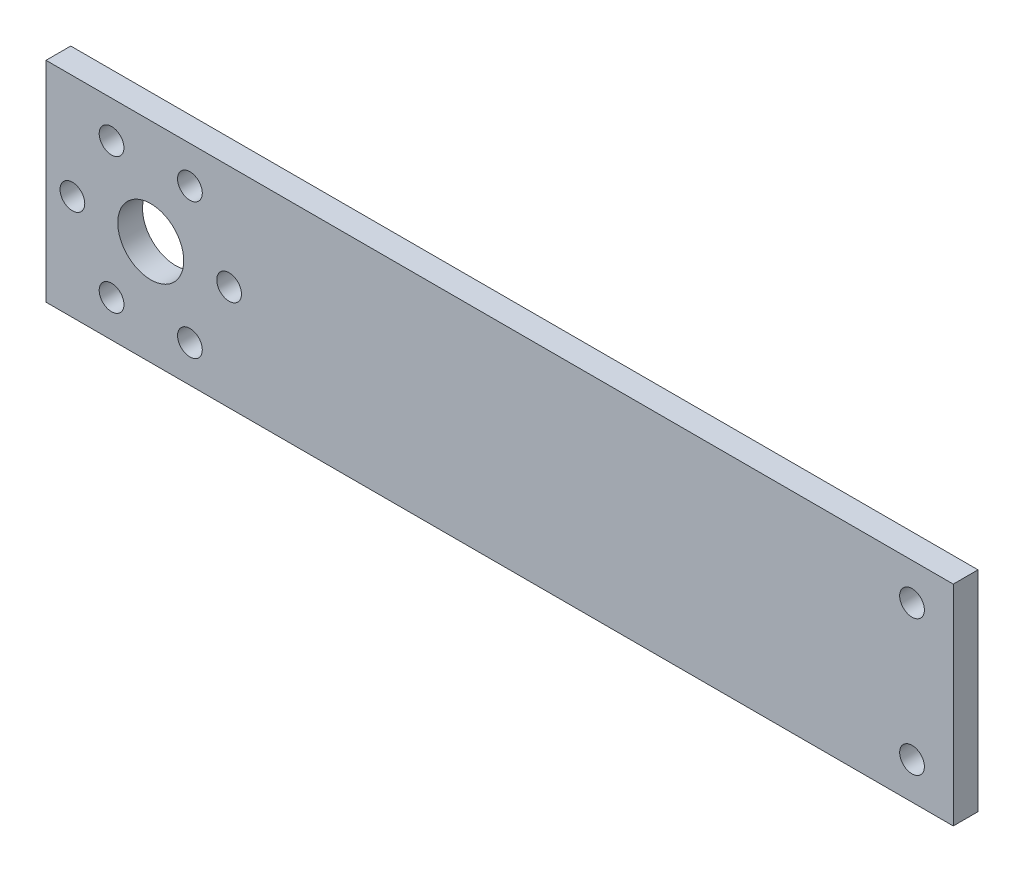
ISO-10303-21;
HEADER;
FILE_DESCRIPTION(('STEP AP214'),'2;1');
FILE_NAME('part.step','',(''),(''),'','','');
FILE_SCHEMA(('AUTOMOTIVE_DESIGN { 1 0 10303 214 1 1 1 1 }'));
ENDSEC;
DATA;
#1=APPLICATION_CONTEXT('core data for automotive mechanical design processes');
#2=APPLICATION_PROTOCOL_DEFINITION('international standard','automotive_design',2000,#1);
#3=PRODUCT_CONTEXT('',#1,'mechanical');
#4=PRODUCT('Part','Part','',(#3));
#5=PRODUCT_RELATED_PRODUCT_CATEGORY('part','',(#4));
#6=PRODUCT_DEFINITION_FORMATION('','',#4);
#7=PRODUCT_DEFINITION_CONTEXT('part definition',#1,'design');
#8=PRODUCT_DEFINITION('design','',#6,#7);
#9=PRODUCT_DEFINITION_SHAPE('','',#8);
#10=(LENGTH_UNIT() NAMED_UNIT(*) SI_UNIT(.MILLI.,.METRE.));
#11=(NAMED_UNIT(*) PLANE_ANGLE_UNIT() SI_UNIT($,.RADIAN.));
#12=(NAMED_UNIT(*) SI_UNIT($,.STERADIAN.) SOLID_ANGLE_UNIT());
#13=UNCERTAINTY_MEASURE_WITH_UNIT(LENGTH_MEASURE(1.E-05),#10,'distance_accuracy_value','');
#14=(GEOMETRIC_REPRESENTATION_CONTEXT(3) GLOBAL_UNCERTAINTY_ASSIGNED_CONTEXT((#13)) GLOBAL_UNIT_ASSIGNED_CONTEXT((#10,
#11,#12)) REPRESENTATION_CONTEXT('',''));
#15=CARTESIAN_POINT('',(0.,0.,0.));
#16=DIRECTION('',(0.,0.,1.));
#17=DIRECTION('',(1.,0.,0.));
#18=AXIS2_PLACEMENT_3D('',#15,#16,#17);
#19=CARTESIAN_POINT('',(110.,0.,3.));
#20=DIRECTION('',(1.,0.,0.));
#21=DIRECTION('',(0.,1.,0.));
#22=AXIS2_PLACEMENT_3D('',#19,#20,#21);
#23=PLANE('',#22);
#24=DIRECTION('',(0.,0.,1.));
#25=VECTOR('',#24,1.);
#26=CARTESIAN_POINT('',(110.,-25.4,3.));
#27=LINE('',#26,#25);
#28=CARTESIAN_POINT('',(110.,-25.4,0.));
#29=VERTEX_POINT('',#28);
#30=CARTESIAN_POINT('',(110.,-25.4,3.));
#31=VERTEX_POINT('',#30);
#32=EDGE_CURVE('E11',#29,#31,#27,.T.);
#33=ORIENTED_EDGE('',*,*,#32,.F.);
#34=DIRECTION('',(0.,1.,0.));
#35=VECTOR('',#34,1.);
#36=CARTESIAN_POINT('',(110.,0.,0.));
#37=LINE('',#36,#35);
#38=CARTESIAN_POINT('',(110.,0.,0.));
#39=VERTEX_POINT('',#38);
#40=EDGE_CURVE('E93',#29,#39,#37,.T.);
#41=ORIENTED_EDGE('',*,*,#40,.T.);
#42=DIRECTION('',(0.,0.,1.));
#43=VECTOR('',#42,1.);
#44=CARTESIAN_POINT('',(110.,0.,3.));
#45=LINE('',#44,#43);
#46=CARTESIAN_POINT('',(110.,0.,3.));
#47=VERTEX_POINT('',#46);
#48=EDGE_CURVE('E47',#39,#47,#45,.T.);
#49=ORIENTED_EDGE('',*,*,#48,.T.);
#50=DIRECTION('',(0.,1.,0.));
#51=VECTOR('',#50,1.);
#52=CARTESIAN_POINT('',(110.,0.,3.));
#53=LINE('',#52,#51);
#54=EDGE_CURVE('E124',#31,#47,#53,.T.);
#55=ORIENTED_EDGE('',*,*,#54,.F.);
#56=EDGE_LOOP('',(#33,#41,#49,#55));
#57=FACE_BOUND('',#56,.T.);
#58=ADVANCED_FACE('F37',(#57),#23,.T.);
#59=CARTESIAN_POINT('',(0.,0.,3.));
#60=DIRECTION('',(0.,1.,0.));
#61=DIRECTION('',(-1.,0.,0.));
#62=AXIS2_PLACEMENT_3D('',#59,#60,#61);
#63=PLANE('',#62);
#64=ORIENTED_EDGE('',*,*,#48,.F.);
#65=DIRECTION('',(1.,0.,0.));
#66=VECTOR('',#65,1.);
#67=CARTESIAN_POINT('',(0.,0.,0.));
#68=LINE('',#67,#66);
#69=CARTESIAN_POINT('',(0.,0.,0.));
#70=VERTEX_POINT('',#69);
#71=EDGE_CURVE('E103',#39,#70,#68,.F.);
#72=ORIENTED_EDGE('',*,*,#71,.T.);
#73=DIRECTION('',(0.,0.,1.));
#74=VECTOR('',#73,1.);
#75=CARTESIAN_POINT('',(0.,0.,3.));
#76=LINE('',#75,#74);
#77=CARTESIAN_POINT('',(0.,0.,3.));
#78=VERTEX_POINT('',#77);
#79=EDGE_CURVE('E55',#70,#78,#76,.T.);
#80=ORIENTED_EDGE('',*,*,#79,.T.);
#81=DIRECTION('',(-1.,0.,0.));
#82=VECTOR('',#81,1.);
#83=CARTESIAN_POINT('',(0.,0.,3.));
#84=LINE('',#83,#82);
#85=EDGE_CURVE('E129',#47,#78,#84,.T.);
#86=ORIENTED_EDGE('',*,*,#85,.F.);
#87=EDGE_LOOP('',(#64,#72,#80,#86));
#88=FACE_BOUND('',#87,.T.);
#89=ADVANCED_FACE('F131',(#88),#63,.T.);
#90=CARTESIAN_POINT('',(0.,0.,3.));
#91=DIRECTION('',(-1.,0.,0.));
#92=DIRECTION('',(0.,-1.,0.));
#93=AXIS2_PLACEMENT_3D('',#90,#91,#92);
#94=PLANE('',#93);
#95=ORIENTED_EDGE('',*,*,#79,.F.);
#96=DIRECTION('',(0.,1.,0.));
#97=VECTOR('',#96,1.);
#98=CARTESIAN_POINT('',(0.,0.,0.));
#99=LINE('',#98,#97);
#100=CARTESIAN_POINT('',(0.,-25.4,0.));
#101=VERTEX_POINT('',#100);
#102=EDGE_CURVE('E92',#70,#101,#99,.F.);
#103=ORIENTED_EDGE('',*,*,#102,.T.);
#104=DIRECTION('',(0.,0.,1.));
#105=VECTOR('',#104,1.);
#106=CARTESIAN_POINT('',(0.,-25.4,3.));
#107=LINE('',#106,#105);
#108=CARTESIAN_POINT('',(0.,-25.4,3.));
#109=VERTEX_POINT('',#108);
#110=EDGE_CURVE('E41',#101,#109,#107,.T.);
#111=ORIENTED_EDGE('',*,*,#110,.T.);
#112=DIRECTION('',(0.,-1.,0.));
#113=VECTOR('',#112,1.);
#114=CARTESIAN_POINT('',(0.,0.,3.));
#115=LINE('',#114,#113);
#116=EDGE_CURVE('E239',#78,#109,#115,.T.);
#117=ORIENTED_EDGE('',*,*,#116,.F.);
#118=EDGE_LOOP('',(#95,#103,#111,#117));
#119=FACE_BOUND('',#118,.T.);
#120=ADVANCED_FACE('F95',(#119),#94,.T.);
#121=CARTESIAN_POINT('',(105.,-20.9272413359522,3.));
#122=DIRECTION('',(0.,0.,1.));
#123=DIRECTION('',(1.,0.,0.));
#124=AXIS2_PLACEMENT_3D('',#121,#122,#123);
#125=CYLINDRICAL_SURFACE('',#124,1.5);
#126=CARTESIAN_POINT('',(105.,-20.9272413359522,3.));
#127=DIRECTION('',(0.,0.,1.));
#128=DIRECTION('',(1.,0.,0.));
#129=AXIS2_PLACEMENT_3D('',#126,#127,#128);
#130=CIRCLE('',#129,1.5);
#131=CARTESIAN_POINT('',(106.5,-20.9272413359522,3.));
#132=VERTEX_POINT('',#131);
#133=EDGE_CURVE('E121',#132,#132,#130,.T.);
#134=ORIENTED_EDGE('',*,*,#133,.T.);
#135=EDGE_LOOP('',(#134));
#136=FACE_BOUND('',#135,.T.);
#137=CARTESIAN_POINT('',(105.,-20.9272413359522,0.));
#138=DIRECTION('',(0.,0.,1.));
#139=DIRECTION('',(1.,0.,0.));
#140=AXIS2_PLACEMENT_3D('',#137,#138,#139);
#141=CIRCLE('',#140,1.5);
#142=CARTESIAN_POINT('',(106.5,-20.9272413359522,0.));
#143=VERTEX_POINT('',#142);
#144=EDGE_CURVE('E149',#143,#143,#141,.T.);
#145=ORIENTED_EDGE('',*,*,#144,.F.);
#146=EDGE_LOOP('',(#145));
#147=FACE_BOUND('',#146,.T.);
#148=ADVANCED_FACE('F171',(#136,#147),#125,.F.);
#149=CARTESIAN_POINT('',(17.4499999999999,-20.9272413359522,3.));
#150=DIRECTION('',(0.,0.,1.));
#151=DIRECTION('',(1.,0.,0.));
#152=AXIS2_PLACEMENT_3D('',#149,#150,#151);
#153=CYLINDRICAL_SURFACE('',#152,1.5);
#154=CARTESIAN_POINT('',(17.4499999999999,-20.9272413359522,3.));
#155=DIRECTION('',(0.,0.,1.));
#156=DIRECTION('',(1.,0.,0.));
#157=AXIS2_PLACEMENT_3D('',#154,#155,#156);
#158=CIRCLE('',#157,1.5);
#159=CARTESIAN_POINT('',(18.9499999999999,-20.9272413359522,3.));
#160=VERTEX_POINT('',#159);
#161=EDGE_CURVE('E229',#160,#160,#158,.T.);
#162=ORIENTED_EDGE('',*,*,#161,.T.);
#163=EDGE_LOOP('',(#162));
#164=FACE_BOUND('',#163,.T.);
#165=CARTESIAN_POINT('',(17.4499999999999,-20.9272413359522,0.));
#166=DIRECTION('',(0.,0.,1.));
#167=DIRECTION('',(1.,0.,0.));
#168=AXIS2_PLACEMENT_3D('',#165,#166,#167);
#169=CIRCLE('',#168,1.5);
#170=CARTESIAN_POINT('',(18.9499999999999,-20.9272413359522,0.));
#171=VERTEX_POINT('',#170);
#172=EDGE_CURVE('E152',#171,#171,#169,.T.);
#173=ORIENTED_EDGE('',*,*,#172,.F.);
#174=EDGE_LOOP('',(#173));
#175=FACE_BOUND('',#174,.T.);
#176=ADVANCED_FACE('F162',(#164,#175),#153,.F.);
#177=CARTESIAN_POINT('',(17.45,-4.47275866404785,3.));
#178=DIRECTION('',(0.,0.,1.));
#179=DIRECTION('',(1.,0.,0.));
#180=AXIS2_PLACEMENT_3D('',#177,#178,#179);
#181=CYLINDRICAL_SURFACE('',#180,1.5);
#182=CARTESIAN_POINT('',(17.45,-4.47275866404785,3.));
#183=DIRECTION('',(0.,0.,1.));
#184=DIRECTION('',(1.,0.,0.));
#185=AXIS2_PLACEMENT_3D('',#182,#183,#184);
#186=CIRCLE('',#185,1.5);
#187=CARTESIAN_POINT('',(18.95,-4.47275866404785,3.));
#188=VERTEX_POINT('',#187);
#189=EDGE_CURVE('E232',#188,#188,#186,.T.);
#190=ORIENTED_EDGE('',*,*,#189,.T.);
#191=EDGE_LOOP('',(#190));
#192=FACE_BOUND('',#191,.T.);
#193=CARTESIAN_POINT('',(17.45,-4.47275866404785,0.));
#194=DIRECTION('',(0.,0.,1.));
#195=DIRECTION('',(1.,0.,0.));
#196=AXIS2_PLACEMENT_3D('',#193,#194,#195);
#197=CIRCLE('',#196,1.5);
#198=CARTESIAN_POINT('',(18.95,-4.47275866404785,0.));
#199=VERTEX_POINT('',#198);
#200=EDGE_CURVE('E99',#199,#199,#197,.T.);
#201=ORIENTED_EDGE('',*,*,#200,.F.);
#202=EDGE_LOOP('',(#201));
#203=FACE_BOUND('',#202,.T.);
#204=ADVANCED_FACE('F159',(#192,#203),#181,.F.);
#205=CARTESIAN_POINT('',(12.7,-12.7,3.));
#206=DIRECTION('',(0.,0.,1.));
#207=DIRECTION('',(1.,0.,0.));
#208=AXIS2_PLACEMENT_3D('',#205,#206,#207);
#209=CYLINDRICAL_SURFACE('',#208,4.);
#210=CARTESIAN_POINT('',(12.7,-12.7,3.));
#211=DIRECTION('',(0.,0.,1.));
#212=DIRECTION('',(1.,0.,0.));
#213=AXIS2_PLACEMENT_3D('',#210,#211,#212);
#214=CIRCLE('',#213,4.);
#215=CARTESIAN_POINT('',(16.7,-12.7,3.));
#216=VERTEX_POINT('',#215);
#217=EDGE_CURVE('E236',#216,#216,#214,.T.);
#218=ORIENTED_EDGE('',*,*,#217,.T.);
#219=EDGE_LOOP('',(#218));
#220=FACE_BOUND('',#219,.T.);
#221=CARTESIAN_POINT('',(12.7,-12.7,0.));
#222=DIRECTION('',(0.,0.,1.));
#223=DIRECTION('',(1.,0.,0.));
#224=AXIS2_PLACEMENT_3D('',#221,#222,#223);
#225=CIRCLE('',#224,4.);
#226=CARTESIAN_POINT('',(16.7,-12.7,0.));
#227=VERTEX_POINT('',#226);
#228=EDGE_CURVE('E96',#227,#227,#225,.T.);
#229=ORIENTED_EDGE('',*,*,#228,.F.);
#230=EDGE_LOOP('',(#229));
#231=FACE_BOUND('',#230,.T.);
#232=ADVANCED_FACE('F161',(#220,#231),#209,.F.);
#233=CARTESIAN_POINT('',(0.,-25.4,3.));
#234=DIRECTION('',(0.,-1.,0.));
#235=DIRECTION('',(1.,0.,0.));
#236=AXIS2_PLACEMENT_3D('',#233,#234,#235);
#237=PLANE('',#236);
#238=DIRECTION('',(1.,0.,0.));
#239=VECTOR('',#238,1.);
#240=CARTESIAN_POINT('',(0.,-25.4,0.));
#241=LINE('',#240,#239);
#242=EDGE_CURVE('E80',#101,#29,#241,.T.);
#243=ORIENTED_EDGE('',*,*,#242,.T.);
#244=ORIENTED_EDGE('',*,*,#32,.T.);
#245=DIRECTION('',(1.,0.,0.));
#246=VECTOR('',#245,1.);
#247=CARTESIAN_POINT('',(0.,-25.4,3.));
#248=LINE('',#247,#246);
#249=EDGE_CURVE('E82',#109,#31,#248,.T.);
#250=ORIENTED_EDGE('',*,*,#249,.F.);
#251=ORIENTED_EDGE('',*,*,#110,.F.);
#252=EDGE_LOOP('',(#243,#244,#250,#251));
#253=FACE_BOUND('',#252,.T.);
#254=ADVANCED_FACE('F79',(#253),#237,.T.);
#255=CARTESIAN_POINT('',(3.2,-12.7,3.));
#256=DIRECTION('',(0.,0.,1.));
#257=DIRECTION('',(1.,0.,0.));
#258=AXIS2_PLACEMENT_3D('',#255,#256,#257);
#259=CYLINDRICAL_SURFACE('',#258,1.5);
#260=CARTESIAN_POINT('',(3.2,-12.7,3.));
#261=DIRECTION('',(0.,0.,1.));
#262=DIRECTION('',(1.,0.,0.));
#263=AXIS2_PLACEMENT_3D('',#260,#261,#262);
#264=CIRCLE('',#263,1.5);
#265=CARTESIAN_POINT('',(4.7,-12.7,3.));
#266=VERTEX_POINT('',#265);
#267=EDGE_CURVE('E132',#266,#266,#264,.T.);
#268=ORIENTED_EDGE('',*,*,#267,.T.);
#269=EDGE_LOOP('',(#268));
#270=FACE_BOUND('',#269,.T.);
#271=CARTESIAN_POINT('',(3.2,-12.7,0.));
#272=DIRECTION('',(0.,0.,1.));
#273=DIRECTION('',(1.,0.,0.));
#274=AXIS2_PLACEMENT_3D('',#271,#272,#273);
#275=CIRCLE('',#274,1.5);
#276=CARTESIAN_POINT('',(4.7,-12.7,0.));
#277=VERTEX_POINT('',#276);
#278=EDGE_CURVE('E105',#277,#277,#275,.T.);
#279=ORIENTED_EDGE('',*,*,#278,.F.);
#280=EDGE_LOOP('',(#279));
#281=FACE_BOUND('',#280,.T.);
#282=ADVANCED_FACE('F185',(#270,#281),#259,.F.);
#283=CARTESIAN_POINT('',(7.95000000000001,-4.47275866404782,3.));
#284=DIRECTION('',(0.,0.,1.));
#285=DIRECTION('',(1.,0.,0.));
#286=AXIS2_PLACEMENT_3D('',#283,#284,#285);
#287=CYLINDRICAL_SURFACE('',#286,1.5);
#288=CARTESIAN_POINT('',(7.95000000000001,-4.47275866404782,3.));
#289=DIRECTION('',(0.,0.,1.));
#290=DIRECTION('',(1.,0.,0.));
#291=AXIS2_PLACEMENT_3D('',#288,#289,#290);
#292=CIRCLE('',#291,1.5);
#293=CARTESIAN_POINT('',(9.45000000000001,-4.47275866404782,3.));
#294=VERTEX_POINT('',#293);
#295=EDGE_CURVE('E135',#294,#294,#292,.T.);
#296=ORIENTED_EDGE('',*,*,#295,.T.);
#297=EDGE_LOOP('',(#296));
#298=FACE_BOUND('',#297,.T.);
#299=CARTESIAN_POINT('',(7.95000000000001,-4.47275866404782,0.));
#300=DIRECTION('',(0.,0.,1.));
#301=DIRECTION('',(1.,0.,0.));
#302=AXIS2_PLACEMENT_3D('',#299,#300,#301);
#303=CIRCLE('',#302,1.5);
#304=CARTESIAN_POINT('',(9.45000000000001,-4.47275866404782,0.));
#305=VERTEX_POINT('',#304);
#306=EDGE_CURVE('E109',#305,#305,#303,.T.);
#307=ORIENTED_EDGE('',*,*,#306,.F.);
#308=EDGE_LOOP('',(#307));
#309=FACE_BOUND('',#308,.T.);
#310=ADVANCED_FACE('F188',(#298,#309),#287,.F.);
#311=CARTESIAN_POINT('',(22.2,-12.7000000000001,3.));
#312=DIRECTION('',(0.,0.,1.));
#313=DIRECTION('',(1.,0.,0.));
#314=AXIS2_PLACEMENT_3D('',#311,#312,#313);
#315=CYLINDRICAL_SURFACE('',#314,1.5);
#316=CARTESIAN_POINT('',(22.2,-12.7000000000001,3.));
#317=DIRECTION('',(0.,0.,1.));
#318=DIRECTION('',(1.,0.,0.));
#319=AXIS2_PLACEMENT_3D('',#316,#317,#318);
#320=CIRCLE('',#319,1.5);
#321=CARTESIAN_POINT('',(23.7,-12.7000000000001,3.));
#322=VERTEX_POINT('',#321);
#323=EDGE_CURVE('E141',#322,#322,#320,.T.);
#324=ORIENTED_EDGE('',*,*,#323,.T.);
#325=EDGE_LOOP('',(#324));
#326=FACE_BOUND('',#325,.T.);
#327=CARTESIAN_POINT('',(22.2,-12.7000000000001,0.));
#328=DIRECTION('',(0.,0.,1.));
#329=DIRECTION('',(1.,0.,0.));
#330=AXIS2_PLACEMENT_3D('',#327,#328,#329);
#331=CIRCLE('',#330,1.5);
#332=CARTESIAN_POINT('',(23.7,-12.7000000000001,0.));
#333=VERTEX_POINT('',#332);
#334=EDGE_CURVE('E112',#333,#333,#331,.T.);
#335=ORIENTED_EDGE('',*,*,#334,.F.);
#336=EDGE_LOOP('',(#335));
#337=FACE_BOUND('',#336,.T.);
#338=ADVANCED_FACE('F192',(#326,#337),#315,.F.);
#339=CARTESIAN_POINT('',(7.9499999999999,-20.9272413359521,3.));
#340=DIRECTION('',(0.,0.,1.));
#341=DIRECTION('',(1.,0.,0.));
#342=AXIS2_PLACEMENT_3D('',#339,#340,#341);
#343=CYLINDRICAL_SURFACE('',#342,1.5);
#344=CARTESIAN_POINT('',(7.9499999999999,-20.9272413359521,3.));
#345=DIRECTION('',(0.,0.,1.));
#346=DIRECTION('',(1.,0.,0.));
#347=AXIS2_PLACEMENT_3D('',#344,#345,#346);
#348=CIRCLE('',#347,1.5);
#349=CARTESIAN_POINT('',(9.4499999999999,-20.9272413359521,3.));
#350=VERTEX_POINT('',#349);
#351=EDGE_CURVE('E144',#350,#350,#348,.T.);
#352=ORIENTED_EDGE('',*,*,#351,.T.);
#353=EDGE_LOOP('',(#352));
#354=FACE_BOUND('',#353,.T.);
#355=CARTESIAN_POINT('',(7.9499999999999,-20.9272413359521,0.));
#356=DIRECTION('',(0.,0.,1.));
#357=DIRECTION('',(1.,0.,0.));
#358=AXIS2_PLACEMENT_3D('',#355,#356,#357);
#359=CIRCLE('',#358,1.5);
#360=CARTESIAN_POINT('',(9.4499999999999,-20.9272413359521,0.));
#361=VERTEX_POINT('',#360);
#362=EDGE_CURVE('E115',#361,#361,#359,.T.);
#363=ORIENTED_EDGE('',*,*,#362,.F.);
#364=EDGE_LOOP('',(#363));
#365=FACE_BOUND('',#364,.T.);
#366=ADVANCED_FACE('F195',(#354,#365),#343,.F.);
#367=CARTESIAN_POINT('',(105.,-4.47275866404784,3.));
#368=DIRECTION('',(0.,0.,1.));
#369=DIRECTION('',(1.,0.,0.));
#370=AXIS2_PLACEMENT_3D('',#367,#368,#369);
#371=CYLINDRICAL_SURFACE('',#370,1.49999999999999);
#372=CARTESIAN_POINT('',(105.,-4.47275866404784,3.));
#373=DIRECTION('',(0.,0.,1.));
#374=DIRECTION('',(-1.,0.,0.));
#375=AXIS2_PLACEMENT_3D('',#372,#373,#374);
#376=CIRCLE('',#375,1.49999999999999);
#377=CARTESIAN_POINT('',(103.5,-4.47275866404784,3.));
#378=VERTEX_POINT('',#377);
#379=EDGE_CURVE('E86',#378,#378,#376,.T.);
#380=ORIENTED_EDGE('',*,*,#379,.T.);
#381=EDGE_LOOP('',(#380));
#382=FACE_BOUND('',#381,.T.);
#383=CARTESIAN_POINT('',(105.,-4.47275866404784,0.));
#384=DIRECTION('',(0.,0.,1.));
#385=DIRECTION('',(1.,0.,0.));
#386=AXIS2_PLACEMENT_3D('',#383,#384,#385);
#387=CIRCLE('',#386,1.49999999999999);
#388=CARTESIAN_POINT('',(106.5,-4.47275866404784,0.));
#389=VERTEX_POINT('',#388);
#390=EDGE_CURVE('E118',#389,#389,#387,.T.);
#391=ORIENTED_EDGE('',*,*,#390,.F.);
#392=EDGE_LOOP('',(#391));
#393=FACE_BOUND('',#392,.T.);
#394=ADVANCED_FACE('F39',(#382,#393),#371,.F.);
#395=CARTESIAN_POINT('',(0.,0.,3.));
#396=DIRECTION('',(0.,0.,1.));
#397=DIRECTION('',(1.,0.,0.));
#398=AXIS2_PLACEMENT_3D('',#395,#396,#397);
#399=PLANE('',#398);
#400=ORIENTED_EDGE('',*,*,#133,.F.);
#401=EDGE_LOOP('',(#400));
#402=FACE_BOUND('',#401,.T.);
#403=ORIENTED_EDGE('',*,*,#161,.F.);
#404=EDGE_LOOP('',(#403));
#405=FACE_BOUND('',#404,.T.);
#406=ORIENTED_EDGE('',*,*,#189,.F.);
#407=EDGE_LOOP('',(#406));
#408=FACE_BOUND('',#407,.T.);
#409=ORIENTED_EDGE('',*,*,#217,.F.);
#410=EDGE_LOOP('',(#409));
#411=FACE_BOUND('',#410,.T.);
#412=ORIENTED_EDGE('',*,*,#116,.T.);
#413=ORIENTED_EDGE('',*,*,#249,.T.);
#414=ORIENTED_EDGE('',*,*,#54,.T.);
#415=ORIENTED_EDGE('',*,*,#85,.T.);
#416=EDGE_LOOP('',(#412,#413,#414,#415));
#417=FACE_BOUND('',#416,.T.);
#418=ORIENTED_EDGE('',*,*,#267,.F.);
#419=EDGE_LOOP('',(#418));
#420=FACE_BOUND('',#419,.T.);
#421=ORIENTED_EDGE('',*,*,#295,.F.);
#422=EDGE_LOOP('',(#421));
#423=FACE_BOUND('',#422,.T.);
#424=ORIENTED_EDGE('',*,*,#323,.F.);
#425=EDGE_LOOP('',(#424));
#426=FACE_BOUND('',#425,.T.);
#427=ORIENTED_EDGE('',*,*,#351,.F.);
#428=EDGE_LOOP('',(#427));
#429=FACE_BOUND('',#428,.T.);
#430=ORIENTED_EDGE('',*,*,#379,.F.);
#431=EDGE_LOOP('',(#430));
#432=FACE_BOUND('',#431,.T.);
#433=ADVANCED_FACE('F127',(#402,#405,#408,#411,#417,#420,#423,#426,#429,#432),#399,.T.);
#434=CARTESIAN_POINT('',(0.,0.,0.));
#435=DIRECTION('',(0.,0.,1.));
#436=DIRECTION('',(1.,0.,0.));
#437=AXIS2_PLACEMENT_3D('',#434,#435,#436);
#438=PLANE('',#437);
#439=ORIENTED_EDGE('',*,*,#144,.T.);
#440=EDGE_LOOP('',(#439));
#441=FACE_BOUND('',#440,.T.);
#442=ORIENTED_EDGE('',*,*,#172,.T.);
#443=EDGE_LOOP('',(#442));
#444=FACE_BOUND('',#443,.T.);
#445=ORIENTED_EDGE('',*,*,#200,.T.);
#446=EDGE_LOOP('',(#445));
#447=FACE_BOUND('',#446,.T.);
#448=ORIENTED_EDGE('',*,*,#228,.T.);
#449=EDGE_LOOP('',(#448));
#450=FACE_BOUND('',#449,.T.);
#451=ORIENTED_EDGE('',*,*,#102,.F.);
#452=ORIENTED_EDGE('',*,*,#71,.F.);
#453=ORIENTED_EDGE('',*,*,#40,.F.);
#454=ORIENTED_EDGE('',*,*,#242,.F.);
#455=EDGE_LOOP('',(#451,#452,#453,#454));
#456=FACE_BOUND('',#455,.T.);
#457=ORIENTED_EDGE('',*,*,#278,.T.);
#458=EDGE_LOOP('',(#457));
#459=FACE_BOUND('',#458,.T.);
#460=ORIENTED_EDGE('',*,*,#306,.T.);
#461=EDGE_LOOP('',(#460));
#462=FACE_BOUND('',#461,.T.);
#463=ORIENTED_EDGE('',*,*,#334,.T.);
#464=EDGE_LOOP('',(#463));
#465=FACE_BOUND('',#464,.T.);
#466=ORIENTED_EDGE('',*,*,#362,.T.);
#467=EDGE_LOOP('',(#466));
#468=FACE_BOUND('',#467,.T.);
#469=ORIENTED_EDGE('',*,*,#390,.T.);
#470=EDGE_LOOP('',(#469));
#471=FACE_BOUND('',#470,.T.);
#472=ADVANCED_FACE('F89',(#441,#444,#447,#450,#456,#459,#462,#465,#468,#471),#438,.F.);
#473=CLOSED_SHELL('',(#58,#89,#120,#148,#176,#204,#232,#254,#282,#310,#338,#366,#394,#433,#472));
#474=MANIFOLD_SOLID_BREP('B2',#473);
#475=ADVANCED_BREP_SHAPE_REPRESENTATION('',(#18,#474),#14);
#476=SHAPE_DEFINITION_REPRESENTATION(#9,#475);
ENDSEC;
END-ISO-10303-21;
